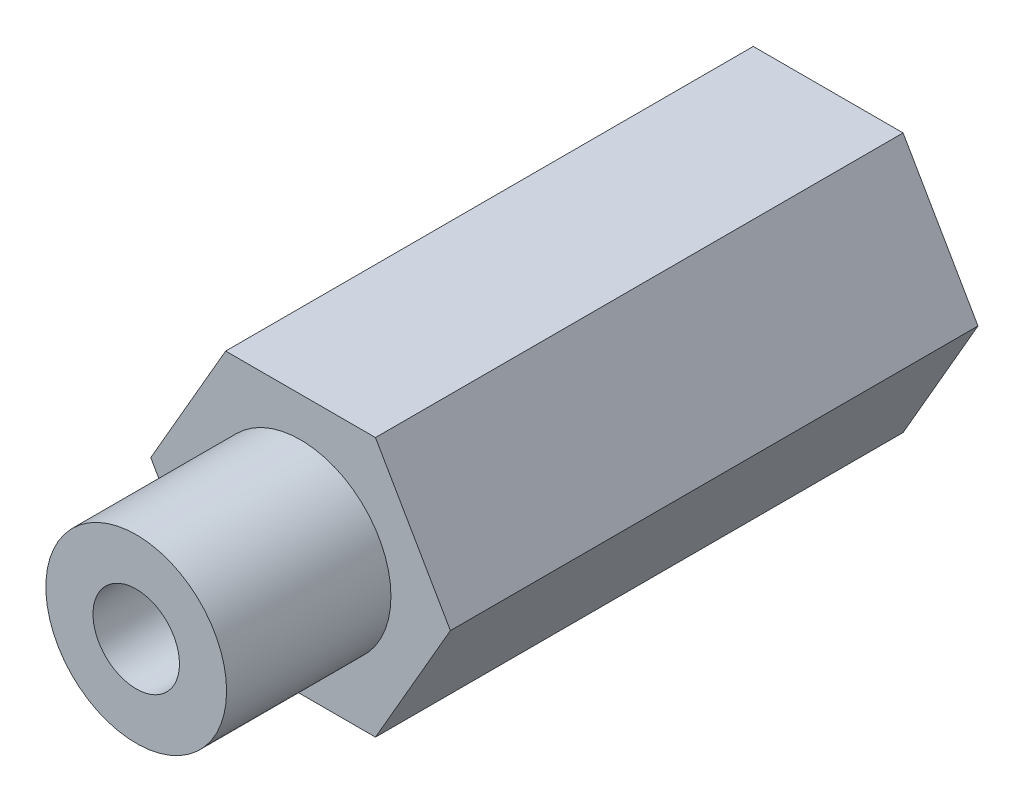
ISO-10303-21;
HEADER;
FILE_DESCRIPTION(('STEP AP214'),'2;1');
FILE_NAME('part.step','',(''),(''),'','','');
FILE_SCHEMA(('AUTOMOTIVE_DESIGN { 1 0 10303 214 1 1 1 1 }'));
ENDSEC;
DATA;
#1=APPLICATION_CONTEXT('core data for automotive mechanical design processes');
#2=APPLICATION_PROTOCOL_DEFINITION('international standard','automotive_design',2000,#1);
#3=PRODUCT_CONTEXT('',#1,'mechanical');
#4=PRODUCT('Part','Part','',(#3));
#5=PRODUCT_RELATED_PRODUCT_CATEGORY('part','',(#4));
#6=PRODUCT_DEFINITION_FORMATION('','',#4);
#7=PRODUCT_DEFINITION_CONTEXT('part definition',#1,'design');
#8=PRODUCT_DEFINITION('design','',#6,#7);
#9=PRODUCT_DEFINITION_SHAPE('','',#8);
#10=(LENGTH_UNIT() NAMED_UNIT(*) SI_UNIT(.MILLI.,.METRE.));
#11=(NAMED_UNIT(*) PLANE_ANGLE_UNIT() SI_UNIT($,.RADIAN.));
#12=(NAMED_UNIT(*) SI_UNIT($,.STERADIAN.) SOLID_ANGLE_UNIT());
#13=UNCERTAINTY_MEASURE_WITH_UNIT(LENGTH_MEASURE(1.E-05),#10,'distance_accuracy_value','');
#14=(GEOMETRIC_REPRESENTATION_CONTEXT(3) GLOBAL_UNCERTAINTY_ASSIGNED_CONTEXT((#13)) GLOBAL_UNIT_ASSIGNED_CONTEXT((#10,
#11,#12)) REPRESENTATION_CONTEXT('',''));
#15=CARTESIAN_POINT('',(0.,0.,0.));
#16=DIRECTION('',(0.,0.,1.));
#17=DIRECTION('',(1.,0.,0.));
#18=AXIS2_PLACEMENT_3D('',#15,#16,#17);
#19=CARTESIAN_POINT('',(0.,0.,0.));
#20=DIRECTION('',(0.,0.,1.));
#21=DIRECTION('',(1.,0.,0.));
#22=AXIS2_PLACEMENT_3D('',#19,#20,#21);
#23=CYLINDRICAL_SURFACE('',#22,3.175);
#24=CARTESIAN_POINT('',(0.,0.,12.065));
#25=DIRECTION('',(0.,0.,-1.));
#26=DIRECTION('',(-1.,0.,0.));
#27=AXIS2_PLACEMENT_3D('',#24,#25,#26);
#28=CIRCLE('',#27,3.175);
#29=CARTESIAN_POINT('',(-3.175,0.,12.065));
#30=VERTEX_POINT('',#29);
#31=EDGE_CURVE('E189',#30,#30,#28,.F.);
#32=ORIENTED_EDGE('',*,*,#31,.F.);
#33=EDGE_LOOP('',(#32));
#34=FACE_BOUND('',#33,.T.);
#35=CARTESIAN_POINT('',(0.,0.,50.8));
#36=DIRECTION('',(0.,0.,1.));
#37=DIRECTION('',(1.,0.,0.));
#38=AXIS2_PLACEMENT_3D('',#35,#36,#37);
#39=CIRCLE('',#38,3.175);
#40=CARTESIAN_POINT('',(3.175,0.,50.8));
#41=VERTEX_POINT('',#40);
#42=EDGE_CURVE('E192',#41,#41,#39,.T.);
#43=ORIENTED_EDGE('',*,*,#42,.T.);
#44=EDGE_LOOP('',(#43));
#45=FACE_BOUND('',#44,.T.);
#46=DIRECTION('',(0.,0.,1.));
#47=VECTOR('',#46,1.);
#48=CARTESIAN_POINT('',(1.98099578203183,-2.48118534405878,0.));
#49=LINE('',#48,#47);
#50=CARTESIAN_POINT('',(1.98099578203183,-2.48118534405879,23.4437758738829));
#51=VERTEX_POINT('',#50);
#52=CARTESIAN_POINT('',(1.98099578203183,-2.48118534405879,15.2912241261171));
#53=VERTEX_POINT('',#52);
#54=EDGE_CURVE('E11',#51,#53,#49,.F.);
#55=ORIENTED_EDGE('',*,*,#54,.F.);
#56=CARTESIAN_POINT('',(1.98099578203183,-2.48118534405878,23.4437758738829));
#57=CARTESIAN_POINT('',(1.92312071460987,-2.52741206421265,23.435214321324));
#58=CARTESIAN_POINT('',(1.86342978352521,-2.57173436993906,23.4285815523475));
#59=CARTESIAN_POINT('',(1.74088786182594,-2.6562092333999,23.4193164783604));
#60=CARTESIAN_POINT('',(1.67803740420779,-2.69636249095205,23.4166835009288));
#61=CARTESIAN_POINT('',(1.55007652557653,-2.77188957747659,23.415561861119));
#62=CARTESIAN_POINT('',(1.48498494376602,-2.80729481401831,23.4170443963517));
#63=CARTESIAN_POINT('',(1.35268256132098,-2.87338675862179,23.4240134070377));
#64=CARTESIAN_POINT('',(1.28547187073009,-2.90407371121557,23.4294996749069));
#65=CARTESIAN_POINT('',(1.08148233738491,-2.9887502671584,23.4516824059001));
#66=CARTESIAN_POINT('',(0.942199486450429,-3.03544164195341,23.4741022299698));
#67=CARTESIAN_POINT('',(0.660897996037743,-3.10887107343725,23.5311392329109));
#68=CARTESIAN_POINT('',(0.518875550320097,-3.13557895682948,23.5657747408355));
#69=CARTESIAN_POINT('',(0.22639000214134,-3.17054117246053,23.6456518320514));
#70=CARTESIAN_POINT('',(0.0759269915497634,-3.17760420453139,23.6914014870087));
#71=CARTESIAN_POINT('',(-0.222924441767528,-3.17069413279405,23.7878074461201));
#72=CARTESIAN_POINT('',(-0.371311553917492,-3.1567082960239,23.8384667028617));
#73=CARTESIAN_POINT('',(-0.694824335264102,-3.10322847098481,23.9513734554995));
#74=CARTESIAN_POINT('',(-0.869109683543074,-3.05904395711647,24.0138444274289));
#75=CARTESIAN_POINT('',(-1.20941128012506,-2.9411435853771,24.1340721794393));
#76=CARTESIAN_POINT('',(-1.37542327313888,-2.86741270343837,24.1918265431537));
#77=CARTESIAN_POINT('',(-1.61746464436229,-2.73373629444187,24.2714360835489));
#78=CARTESIAN_POINT('',(-1.6981875288251,-2.68436511709161,24.29714599282));
#79=CARTESIAN_POINT('',(-1.85558062130117,-2.57807081578418,24.3450641792581));
#80=CARTESIAN_POINT('',(-1.93225292324458,-2.52115164821748,24.367274277647));
#81=CARTESIAN_POINT('',(-2.08072268357535,-2.40008059578966,24.4075046587543));
#82=CARTESIAN_POINT('',(-2.1525246132572,-2.33593549279418,24.4255288223019));
#83=CARTESIAN_POINT('',(-2.29050424159154,-2.20080282868296,24.4568269855672));
#84=CARTESIAN_POINT('',(-2.35668310014828,-2.12981668518834,24.4701019667496));
#85=CARTESIAN_POINT('',(-2.47390545220642,-1.99184475213291,24.4899734838976));
#86=CARTESIAN_POINT('',(-2.52577765520782,-1.92565708057524,24.4972385088627));
#87=CARTESIAN_POINT('',(-2.62425603299177,-1.78913134012449,24.5077092881958));
#88=CARTESIAN_POINT('',(-2.67086052616645,-1.71879195672953,24.5109137496272));
#89=CARTESIAN_POINT('',(-2.75830940645527,-1.57462782410492,24.5131661989776));
#90=CARTESIAN_POINT('',(-2.79915838115736,-1.50080591408959,24.5122175168371));
#91=CARTESIAN_POINT('',(-2.8748033514732,-1.35027427879756,24.5062045534294));
#92=CARTESIAN_POINT('',(-2.90959712642555,-1.27356350656295,24.5011387661159));
#93=CARTESIAN_POINT('',(-2.99854106947457,-1.05473915779737,24.4812671999455));
#94=CARTESIAN_POINT('',(-3.04550891246103,-0.910031449468917,24.4618943367732));
#95=CARTESIAN_POINT('',(-3.1180425693559,-0.617428254270854,24.4116544190943));
#96=CARTESIAN_POINT('',(-3.1436057837835,-0.469532382451901,24.3807859691658));
#97=CARTESIAN_POINT('',(-3.17454030874151,-0.165758953741819,24.3079985452695));
#98=CARTESIAN_POINT('',(-3.17873406695874,-0.00988609552184648,24.265568615379));
#99=CARTESIAN_POINT('',(-3.16469077807839,0.298782765191898,24.1737948964452));
#100=CARTESIAN_POINT('',(-3.14643876680074,0.451576645935184,24.1244465144389));
#101=CARTESIAN_POINT('',(-3.08438049040226,0.773112037410079,24.0150876029896));
#102=CARTESIAN_POINT('',(-3.03732386025794,0.941051015194965,23.9545564266041));
#103=CARTESIAN_POINT('',(-2.91625559492777,1.26743074278379,23.8346114177043));
#104=CARTESIAN_POINT('',(-2.84223584363741,1.42586861594175,23.7751979272908));
#105=CARTESIAN_POINT('',(-2.67584269956907,1.71635497967397,23.6690311325829));
#106=CARTESIAN_POINT('',(-2.58579438488232,1.8494893926522,23.6216154305517));
#107=CARTESIAN_POINT('',(-2.38430327943641,2.10280480076934,23.5384408675835));
#108=CARTESIAN_POINT('',(-2.27287747391838,2.22299596223462,23.5026728125962));
#109=CARTESIAN_POINT('',(-2.09056670623055,2.39105016432318,23.4616560983209));
#110=CARTESIAN_POINT('',(-2.02686697633844,2.44529863867784,23.4500609737136));
#111=CARTESIAN_POINT('',(-1.89495241369531,2.54888124289299,23.4317390099958));
#112=CARTESIAN_POINT('',(-1.82674013715152,2.59821811599988,23.4250094400528));
#113=CARTESIAN_POINT('',(-1.6865152669383,2.69135053094324,23.4167674899596));
#114=CARTESIAN_POINT('',(-1.61450965612837,2.73515578291185,23.4152458417448));
#115=CARTESIAN_POINT('',(-1.46734189245532,2.81684305037821,23.417473409102));
#116=CARTESIAN_POINT('',(-1.39218219285023,2.85472956499727,23.4212185992183));
#117=CARTESIAN_POINT('',(-1.28982732816709,2.90134292616073,23.4296313026857));
#118=CARTESIAN_POINT('',(-1.26366650890269,2.91283156591623,23.4320642483775));
#119=CARTESIAN_POINT('',(-1.21113194501523,2.93506315074815,23.4374982217431));
#120=CARTESIAN_POINT('',(-1.18475855132721,2.94580712117742,23.4404984461926));
#121=CARTESIAN_POINT('',(-1.15827164843668,2.95618534405877,23.4437758738836));
#122=B_SPLINE_CURVE_WITH_KNOTS('',3,(#56,#57,#58,#59,#60,#61,#62,#63,#64,#65,#66,#67,#68,#69,
#70,#71,#72,#73,#74,#75,#76,#77,#78,#79,#80,#81,#82,#83,#84,#85,#86,#87,#88,#89,#90,#91,#92,#93,
#94,#95,#96,#97,#98,#99,#100,#101,#102,#103,#104,#105,#106,#107,#108,#109,#110,#111,#112,#113,
#114,#115,#116,#117,#118,#119,#120,#121),.UNSPECIFIED.,.F.,.F.,(4,2,2,2,2,2,2,2,2,2,2,2,2,2,2,2,
2,2,2,2,2,2,2,2,2,2,2,2,2,2,2,2,4),(0.,0.22363096093822,0.447224322217706,0.669256819488117,
0.891277805716111,1.33481690459422,1.7790243640916,2.24963672880022,2.72053389258267,
3.2891365264143,3.85802865729692,4.15182846041228,4.44547486828787,4.73884793655203,
5.0321603413506,5.28502750375784,5.53797516216531,5.7907200473531,6.0435574288217,
6.50141703541388,6.95933223861237,7.44222702369258,7.92544392041047,8.47703326920059,
9.02878878796331,9.52960966851272,10.0300342632666,10.2831016648069,10.5360269196985,
10.7885018318122,11.0407838816506,11.1267994979963,11.2126942225291),.UNSPECIFIED.);
#123=CARTESIAN_POINT('',(-1.15827164843663,2.95618534405878,23.4437758738829));
#124=VERTEX_POINT('',#123);
#125=EDGE_CURVE('E110',#51,#124,#122,.T.);
#126=ORIENTED_EDGE('',*,*,#125,.T.);
#127=DIRECTION('',(0.,0.,1.));
#128=VECTOR('',#127,1.);
#129=CARTESIAN_POINT('',(-1.15827164843663,2.95618534405877,0.));
#130=LINE('',#129,#128);
#131=CARTESIAN_POINT('',(-1.15827164843663,2.95618534405878,15.2912241261171));
#132=VERTEX_POINT('',#131);
#133=EDGE_CURVE('E54',#132,#124,#130,.T.);
#134=ORIENTED_EDGE('',*,*,#133,.F.);
#135=CARTESIAN_POINT('',(-1.15827164843663,2.95618534405877,15.2912241261171));
#136=CARTESIAN_POINT('',(-1.22724269613449,2.92917742550255,15.299785678676));
#137=CARTESIAN_POINT('',(-1.29547240439019,2.8996447156709,15.3064184476524));
#138=CARTESIAN_POINT('',(-1.42990074297814,2.83575773018119,15.3156835216396));
#139=CARTESIAN_POINT('',(-1.49609971287207,2.80140426602047,15.3183164990712));
#140=CARTESIAN_POINT('',(-1.62548852779178,2.72835043769749,15.319438138881));
#141=CARTESIAN_POINT('',(-1.68869615296916,2.68968209254793,15.3179556036483));
#142=CARTESIAN_POINT('',(-1.81208464720381,2.60815084067106,15.3109865929623));
#143=CARTESIAN_POINT('',(-1.87226567301019,2.56528815151035,15.3055003250931));
#144=CARTESIAN_POINT('',(-2.04759248823426,2.4309663114987,15.2833175940999));
#145=CARTESIAN_POINT('',(-2.15766983041159,2.33368951167542,15.2608977700302));
#146=CARTESIAN_POINT('',(-2.36191232866839,2.12678999059754,15.2038607670891));
#147=CARTESIAN_POINT('',(-2.45605325702619,2.01714888639457,15.1692252591645));
#148=CARTESIAN_POINT('',(-2.63257419802465,1.78133007924747,15.0893481679486));
#149=CARTESIAN_POINT('',(-2.71392246852155,1.65455680578071,15.0435985129913));
#150=CARTESIAN_POINT('',(-2.85736388751369,1.39228883670188,14.9471925538799));
#151=CARTESIAN_POINT('',(-2.91944535365253,1.25678890960072,14.8965332971383));
#152=CARTESIAN_POINT('',(-3.03488685725204,0.949878709986052,14.7836265445005));
#153=CARTESIAN_POINT('',(-3.08376461992767,0.776850913934872,14.7211555725711));
#154=CARTESIAN_POINT('',(-3.15181070117675,0.423190900476785,14.6009278205606));
#155=CARTESIAN_POINT('',(-3.17096388088128,0.242554856224572,14.5431734568463));
#156=CARTESIAN_POINT('',(-3.17621740041534,-0.0338973245199778,14.4635639164511));
#157=CARTESIAN_POINT('',(-3.17382214884668,-0.128490981806659,14.43785400718));
#158=CARTESIAN_POINT('',(-3.16046512987495,-0.31794454892484,14.3899358207419));
#159=CARTESIAN_POINT('',(-3.14950783577163,-0.412804293957816,14.367725722353));
#160=CARTESIAN_POINT('',(-3.11889210887161,-0.601918404311962,14.3274953412457));
#161=CARTESIAN_POINT('',(-3.09924178499008,-0.696173250954926,14.3094711776981));
#162=CARTESIAN_POINT('',(-3.05120327915586,-0.88323344635281,14.2781730144328));
#163=CARTESIAN_POINT('',(-3.0228169048512,-0.976039090803713,14.2648980332504));
#164=CARTESIAN_POINT('',(-2.96194088184503,-1.14654259210515,14.2450265161024));
#165=CARTESIAN_POINT('',(-2.93055677835945,-1.22455907343345,14.2377614911373));
#166=CARTESIAN_POINT('',(-2.86156120775058,-1.37810672054321,14.2272907118042));
#167=CARTESIAN_POINT('',(-2.82394776143136,-1.45363708726046,14.2240862503728));
#168=CARTESIAN_POINT('',(-2.74282240040831,-1.60145210543538,14.2218338010224));
#169=CARTESIAN_POINT('',(-2.69931523833018,-1.67373931025361,14.2227824831629));
#170=CARTESIAN_POINT('',(-2.606773503252,-1.81451559386166,14.2287954465706));
#171=CARTESIAN_POINT('',(-2.55773691322908,-1.88300327298125,14.2338612338841));
#172=CARTESIAN_POINT('',(-2.41270143975601,-2.06944316155725,14.2537328000545));
#173=CARTESIAN_POINT('',(-2.31086480971337,-2.18247236090872,14.2731056632268));
#174=CARTESIAN_POINT('',(-2.09372983789079,-2.39158994800809,14.3233455809057));
#175=CARTESIAN_POINT('',(-1.97842986299452,-2.48767627701425,14.3542140308342));
#176=CARTESIAN_POINT('',(-1.7308216192159,-2.66635307583693,14.4270014547305));
#177=CARTESIAN_POINT('',(-1.59792864334552,-2.74792140610037,14.469431384621));
#178=CARTESIAN_POINT('',(-1.32359192417004,-2.89009399153417,14.5612051035548));
#179=CARTESIAN_POINT('',(-1.18214253626473,-2.95068422646922,14.6105534855611));
#180=CARTESIAN_POINT('',(-0.872655580832449,-3.0577078783305,14.7199123970104));
#181=CARTESIAN_POINT('',(-0.703687844712989,-3.10092513010148,14.7804435733959));
#182=CARTESIAN_POINT('',(-0.36050057667574,-3.15926680052785,14.9003885822957));
#183=CARTESIAN_POINT('',(-0.186279477954181,-3.17438275210757,14.9598020727092));
#184=CARTESIAN_POINT('',(0.148485664525052,-3.17552524419493,15.0659688674171));
#185=CARTESIAN_POINT('',(0.3088076056255,-3.16410832259735,15.1133845694483));
#186=CARTESIAN_POINT('',(0.628930736947921,-3.11626961070314,15.1965591324165));
#187=CARTESIAN_POINT('',(0.788732238846228,-3.07986761322003,15.2323271874038));
#188=CARTESIAN_POINT('',(1.02542683091156,-3.00600895806321,15.2733439016791));
#189=CARTESIAN_POINT('',(1.10425725276529,-2.97796761093976,15.2849390262864));
#190=CARTESIAN_POINT('',(1.25991970072733,-2.91551755066927,15.3032609900042));
#191=CARTESIAN_POINT('',(1.33675282445308,-2.88111242288583,15.3099905599472));
#192=CARTESIAN_POINT('',(1.48752029681643,-2.80624033051048,15.3182325100404));
#193=CARTESIAN_POINT('',(1.56145956324539,-2.76578426831837,15.3197541582553));
#194=CARTESIAN_POINT('',(1.70578669387352,-2.67917688009255,15.317526590898));
#195=CARTESIAN_POINT('',(1.77617722779703,-2.63302992820326,15.3137814007817));
#196=CARTESIAN_POINT('',(1.86772301506192,-2.56769469576847,15.3053686973144));
#197=CARTESIAN_POINT('',(1.89075287857732,-2.55078308157944,15.3029357516225));
#198=CARTESIAN_POINT('',(1.93627327775188,-2.51640260709212,15.2975017782569));
#199=CARTESIAN_POINT('',(1.95876452592515,-2.49893456338892,15.2945015538074));
#200=CARTESIAN_POINT('',(1.9809957820318,-2.48118534405883,15.2912241261164));
#201=B_SPLINE_CURVE_WITH_KNOTS('',3,(#135,#136,#137,#138,#139,#140,#141,#142,#143,#144,#145,
#146,#147,#148,#149,#150,#151,#152,#153,#154,#155,#156,#157,#158,#159,#160,#161,#162,#163,#164,
#165,#166,#167,#168,#169,#170,#171,#172,#173,#174,#175,#176,#177,#178,#179,#180,#181,#182,#183,
#184,#185,#186,#187,#188,#189,#190,#191,#192,#193,#194,#195,#196,#197,#198,#199,#200),
.UNSPECIFIED.,.F.,.F.,(4,2,2,2,2,2,2,2,2,2,2,2,2,2,2,2,2,2,2,2,2,2,2,2,2,2,2,2,2,2,2,2,4),(0.,
0.22363096093822,0.447224322217707,0.669256819488118,0.891277805716112,1.33481690459422,
1.7790243640916,2.24963672880022,2.72053389258267,3.28913652641431,3.85802865729692,
4.15182846041228,4.44547486828788,4.73884793655203,5.0321603413506,5.28502750375784,
5.53797516216531,5.7907200473531,6.0435574288217,6.50141703541388,6.95933223861237,
7.44222702369258,7.92544392041047,8.4770332692006,9.02878878796331,9.52960966851273,
10.0300342632666,10.2831016648069,10.5360269196985,10.7885018318122,11.0407838816506,
11.1267994979963,11.2126942225291),.UNSPECIFIED.);
#202=EDGE_CURVE('E119',#132,#53,#201,.T.);
#203=ORIENTED_EDGE('',*,*,#202,.T.);
#204=EDGE_LOOP('',(#55,#126,#134,#203));
#205=FACE_BOUND('',#204,.T.);
#206=ADVANCED_FACE('F45',(#34,#45,#205),#23,.F.);
#207=CARTESIAN_POINT('',(10.9985226280624,0.,50.8));
#208=DIRECTION('',(-0.866025403784438,-0.5,0.));
#209=DIRECTION('',(0.5,-0.866025403784439,0.));
#210=AXIS2_PLACEMENT_3D('',#207,#208,#209);
#211=PLANE('',#210);
#212=DIRECTION('',(-0.5,0.866025403784439,0.));
#213=VECTOR('',#212,1.);
#214=CARTESIAN_POINT('',(10.9985226280624,0.,38.735));
#215=LINE('',#214,#213);
#216=CARTESIAN_POINT('',(10.9985226280624,0.,38.735));
#217=VERTEX_POINT('',#216);
#218=CARTESIAN_POINT('',(5.49926131403119,9.525,38.735));
#219=VERTEX_POINT('',#218);
#220=EDGE_CURVE('E371',#217,#219,#215,.T.);
#221=ORIENTED_EDGE('',*,*,#220,.F.);
#222=DIRECTION('',(0.,0.,-1.));
#223=VECTOR('',#222,1.);
#224=CARTESIAN_POINT('',(10.9985226280624,0.,50.8));
#225=LINE('',#224,#223);
#226=CARTESIAN_POINT('',(10.9985226280624,0.,0.));
#227=VERTEX_POINT('',#226);
#228=EDGE_CURVE('E225',#217,#227,#225,.T.);
#229=ORIENTED_EDGE('',*,*,#228,.T.);
#230=DIRECTION('',(-0.5,0.866025403784439,0.));
#231=VECTOR('',#230,1.);
#232=CARTESIAN_POINT('',(10.9985226280624,0.,0.));
#233=LINE('',#232,#231);
#234=CARTESIAN_POINT('',(5.49926131403119,9.525,0.));
#235=VERTEX_POINT('',#234);
#236=EDGE_CURVE('E195',#227,#235,#233,.T.);
#237=ORIENTED_EDGE('',*,*,#236,.T.);
#238=DIRECTION('',(0.,0.,-1.));
#239=VECTOR('',#238,1.);
#240=CARTESIAN_POINT('',(5.49926131403119,9.525,50.8));
#241=LINE('',#240,#239);
#242=EDGE_CURVE('E240',#219,#235,#241,.T.);
#243=ORIENTED_EDGE('',*,*,#242,.F.);
#244=EDGE_LOOP('',(#221,#229,#237,#243));
#245=FACE_BOUND('',#244,.T.);
#246=ADVANCED_FACE('F47',(#245),#211,.F.);
#247=CARTESIAN_POINT('',(5.49926131403119,9.525,50.8));
#248=DIRECTION('',(0.,-1.,0.));
#249=DIRECTION('',(1.,0.,0.));
#250=AXIS2_PLACEMENT_3D('',#247,#248,#249);
#251=PLANE('',#250);
#252=DIRECTION('',(-1.,0.,0.));
#253=VECTOR('',#252,1.);
#254=CARTESIAN_POINT('',(5.49926131403119,9.525,38.735));
#255=LINE('',#254,#253);
#256=CARTESIAN_POINT('',(-5.49926131403119,9.525,38.735));
#257=VERTEX_POINT('',#256);
#258=EDGE_CURVE('E376',#219,#257,#255,.T.);
#259=ORIENTED_EDGE('',*,*,#258,.F.);
#260=ORIENTED_EDGE('',*,*,#242,.T.);
#261=DIRECTION('',(-1.,0.,0.));
#262=VECTOR('',#261,1.);
#263=CARTESIAN_POINT('',(5.49926131403119,9.525,0.));
#264=LINE('',#263,#262);
#265=CARTESIAN_POINT('',(-5.49926131403119,9.525,0.));
#266=VERTEX_POINT('',#265);
#267=EDGE_CURVE('E200',#235,#266,#264,.T.);
#268=ORIENTED_EDGE('',*,*,#267,.T.);
#269=DIRECTION('',(0.,0.,-1.));
#270=VECTOR('',#269,1.);
#271=CARTESIAN_POINT('',(-5.49926131403119,9.525,50.8));
#272=LINE('',#271,#270);
#273=EDGE_CURVE('E237',#257,#266,#272,.T.);
#274=ORIENTED_EDGE('',*,*,#273,.F.);
#275=EDGE_LOOP('',(#259,#260,#268,#274));
#276=FACE_BOUND('',#275,.T.);
#277=ADVANCED_FACE('F184',(#276),#251,.F.);
#278=CARTESIAN_POINT('',(-5.49926131403119,9.525,50.8));
#279=DIRECTION('',(0.866025403784439,-0.5,0.));
#280=DIRECTION('',(0.5,0.866025403784439,0.));
#281=AXIS2_PLACEMENT_3D('',#278,#279,#280);
#282=PLANE('',#281);
#283=DIRECTION('',(-0.5,-0.866025403784439,0.));
#284=VECTOR('',#283,1.);
#285=CARTESIAN_POINT('',(-5.49926131403119,9.525,38.735));
#286=LINE('',#285,#284);
#287=CARTESIAN_POINT('',(-10.9985226280624,0.,38.735));
#288=VERTEX_POINT('',#287);
#289=EDGE_CURVE('E384',#257,#288,#286,.T.);
#290=ORIENTED_EDGE('',*,*,#289,.F.);
#291=ORIENTED_EDGE('',*,*,#273,.T.);
#292=DIRECTION('',(-0.5,-0.866025403784439,0.));
#293=VECTOR('',#292,1.);
#294=CARTESIAN_POINT('',(-5.49926131403119,9.525,0.));
#295=LINE('',#294,#293);
#296=CARTESIAN_POINT('',(-10.9985226280624,0.,0.));
#297=VERTEX_POINT('',#296);
#298=EDGE_CURVE('E209',#266,#297,#295,.T.);
#299=ORIENTED_EDGE('',*,*,#298,.T.);
#300=DIRECTION('',(0.,0.,-1.));
#301=VECTOR('',#300,1.);
#302=CARTESIAN_POINT('',(-10.9985226280624,0.,50.8));
#303=LINE('',#302,#301);
#304=EDGE_CURVE('E234',#288,#297,#303,.T.);
#305=ORIENTED_EDGE('',*,*,#304,.F.);
#306=EDGE_LOOP('',(#290,#291,#299,#305));
#307=FACE_BOUND('',#306,.T.);
#308=ADVANCED_FACE('F259',(#307),#282,.F.);
#309=CARTESIAN_POINT('',(-10.9985226280624,0.,50.8));
#310=DIRECTION('',(0.866025403784439,0.5,0.));
#311=DIRECTION('',(-0.5,0.866025403784439,0.));
#312=AXIS2_PLACEMENT_3D('',#309,#310,#311);
#313=PLANE('',#312);
#314=CARTESIAN_POINT('',(-8.24889197104679,-4.7625,19.3675));
#315=DIRECTION('',(-0.866025403784439,-0.5,0.));
#316=DIRECTION('',(0.5,-0.866025403784439,0.));
#317=AXIS2_PLACEMENT_3D('',#314,#315,#316);
#318=CIRCLE('',#317,5.145);
#319=CARTESIAN_POINT('',(-5.67639197104679,-9.21820070247094,19.3675));
#320=VERTEX_POINT('',#319);
#321=EDGE_CURVE('E124',#320,#320,#318,.T.);
#322=ORIENTED_EDGE('',*,*,#321,.F.);
#323=EDGE_LOOP('',(#322));
#324=FACE_BOUND('',#323,.T.);
#325=DIRECTION('',(0.5,-0.866025403784439,0.));
#326=VECTOR('',#325,1.);
#327=CARTESIAN_POINT('',(-10.9985226280624,0.,38.735));
#328=LINE('',#327,#326);
#329=CARTESIAN_POINT('',(-5.49926131403119,-9.525,38.735));
#330=VERTEX_POINT('',#329);
#331=EDGE_CURVE('E202',#288,#330,#328,.T.);
#332=ORIENTED_EDGE('',*,*,#331,.F.);
#333=ORIENTED_EDGE('',*,*,#304,.T.);
#334=DIRECTION('',(0.5,-0.866025403784439,0.));
#335=VECTOR('',#334,1.);
#336=CARTESIAN_POINT('',(-10.9985226280624,0.,0.));
#337=LINE('',#336,#335);
#338=CARTESIAN_POINT('',(-5.49926131403119,-9.525,0.));
#339=VERTEX_POINT('',#338);
#340=EDGE_CURVE('E213',#297,#339,#337,.T.);
#341=ORIENTED_EDGE('',*,*,#340,.T.);
#342=DIRECTION('',(0.,0.,-1.));
#343=VECTOR('',#342,1.);
#344=CARTESIAN_POINT('',(-5.49926131403119,-9.525,50.8));
#345=LINE('',#344,#343);
#346=EDGE_CURVE('E231',#330,#339,#345,.T.);
#347=ORIENTED_EDGE('',*,*,#346,.F.);
#348=EDGE_LOOP('',(#332,#333,#341,#347));
#349=FACE_BOUND('',#348,.T.);
#350=ADVANCED_FACE('F255',(#324,#349),#313,.F.);
#351=CARTESIAN_POINT('',(-5.49926131403119,-9.525,50.8));
#352=DIRECTION('',(0.,1.,0.));
#353=DIRECTION('',(-1.,0.,0.));
#354=AXIS2_PLACEMENT_3D('',#351,#352,#353);
#355=PLANE('',#354);
#356=DIRECTION('',(1.,0.,0.));
#357=VECTOR('',#356,1.);
#358=CARTESIAN_POINT('',(-5.49926131403119,-9.525,38.735));
#359=LINE('',#358,#357);
#360=CARTESIAN_POINT('',(5.49926131403119,-9.525,38.735));
#361=VERTEX_POINT('',#360);
#362=EDGE_CURVE('E68',#330,#361,#359,.T.);
#363=ORIENTED_EDGE('',*,*,#362,.F.);
#364=ORIENTED_EDGE('',*,*,#346,.T.);
#365=DIRECTION('',(1.,0.,0.));
#366=VECTOR('',#365,1.);
#367=CARTESIAN_POINT('',(-5.49926131403119,-9.525,0.));
#368=LINE('',#367,#366);
#369=CARTESIAN_POINT('',(5.49926131403119,-9.525,0.));
#370=VERTEX_POINT('',#369);
#371=EDGE_CURVE('E217',#339,#370,#368,.T.);
#372=ORIENTED_EDGE('',*,*,#371,.T.);
#373=DIRECTION('',(0.,0.,-1.));
#374=VECTOR('',#373,1.);
#375=CARTESIAN_POINT('',(5.49926131403119,-9.525,50.8));
#376=LINE('',#375,#374);
#377=EDGE_CURVE('E228',#361,#370,#376,.T.);
#378=ORIENTED_EDGE('',*,*,#377,.F.);
#379=EDGE_LOOP('',(#363,#364,#372,#378));
#380=FACE_BOUND('',#379,.T.);
#381=ADVANCED_FACE('F258',(#380),#355,.F.);
#382=CARTESIAN_POINT('',(5.49926131403119,-9.525,50.8));
#383=DIRECTION('',(-0.866025403784439,0.5,0.));
#384=DIRECTION('',(-0.5,-0.866025403784439,0.));
#385=AXIS2_PLACEMENT_3D('',#382,#383,#384);
#386=PLANE('',#385);
#387=DIRECTION('',(0.5,0.866025403784439,0.));
#388=VECTOR('',#387,1.);
#389=CARTESIAN_POINT('',(5.49926131403119,-9.525,38.735));
#390=LINE('',#389,#388);
#391=EDGE_CURVE('E368',#361,#217,#390,.T.);
#392=ORIENTED_EDGE('',*,*,#391,.F.);
#393=ORIENTED_EDGE('',*,*,#377,.T.);
#394=DIRECTION('',(0.5,0.866025403784439,0.));
#395=VECTOR('',#394,1.);
#396=CARTESIAN_POINT('',(5.49926131403119,-9.525,0.));
#397=LINE('',#396,#395);
#398=EDGE_CURVE('E221',#370,#227,#397,.T.);
#399=ORIENTED_EDGE('',*,*,#398,.T.);
#400=ORIENTED_EDGE('',*,*,#228,.F.);
#401=EDGE_LOOP('',(#392,#393,#399,#400));
#402=FACE_BOUND('',#401,.T.);
#403=ADVANCED_FACE('F342',(#402),#386,.F.);
#404=CARTESIAN_POINT('',(0.,0.,50.8));
#405=DIRECTION('',(0.,0.,1.));
#406=DIRECTION('',(1.,0.,0.));
#407=AXIS2_PLACEMENT_3D('',#404,#405,#406);
#408=PLANE('',#407);
#409=ORIENTED_EDGE('',*,*,#42,.F.);
#410=EDGE_LOOP('',(#409));
#411=FACE_BOUND('',#410,.T.);
#412=CARTESIAN_POINT('',(0.,0.,50.8));
#413=DIRECTION('',(0.,0.,1.));
#414=DIRECTION('',(1.,0.,0.));
#415=AXIS2_PLACEMENT_3D('',#412,#413,#414);
#416=CIRCLE('',#415,6.635);
#417=CARTESIAN_POINT('',(6.635,0.,50.8));
#418=VERTEX_POINT('',#417);
#419=EDGE_CURVE('E244',#418,#418,#416,.T.);
#420=ORIENTED_EDGE('',*,*,#419,.T.);
#421=EDGE_LOOP('',(#420));
#422=FACE_BOUND('',#421,.T.);
#423=ADVANCED_FACE('F174',(#411,#422),#408,.T.);
#424=CARTESIAN_POINT('',(0.,0.,0.));
#425=DIRECTION('',(0.,0.,1.));
#426=DIRECTION('',(1.,0.,0.));
#427=AXIS2_PLACEMENT_3D('',#424,#425,#426);
#428=PLANE('',#427);
#429=CARTESIAN_POINT('',(0.,0.,0.));
#430=DIRECTION('',(0.,0.,-1.));
#431=DIRECTION('',(-1.,0.,0.));
#432=AXIS2_PLACEMENT_3D('',#429,#430,#431);
#433=CIRCLE('',#432,6.86);
#434=CARTESIAN_POINT('',(-6.86,0.,0.));
#435=VERTEX_POINT('',#434);
#436=EDGE_CURVE('E127',#435,#435,#433,.T.);
#437=ORIENTED_EDGE('',*,*,#436,.F.);
#438=EDGE_LOOP('',(#437));
#439=FACE_BOUND('',#438,.T.);
#440=ORIENTED_EDGE('',*,*,#236,.F.);
#441=ORIENTED_EDGE('',*,*,#398,.F.);
#442=ORIENTED_EDGE('',*,*,#371,.F.);
#443=ORIENTED_EDGE('',*,*,#340,.F.);
#444=ORIENTED_EDGE('',*,*,#298,.F.);
#445=ORIENTED_EDGE('',*,*,#267,.F.);
#446=EDGE_LOOP('',(#440,#441,#442,#443,#444,#445));
#447=FACE_BOUND('',#446,.T.);
#448=ADVANCED_FACE('F168',(#439,#447),#428,.F.);
#449=CARTESIAN_POINT('',(0.,0.,38.735));
#450=DIRECTION('',(0.,0.,1.));
#451=DIRECTION('',(1.,0.,0.));
#452=AXIS2_PLACEMENT_3D('',#449,#450,#451);
#453=PLANE('',#452);
#454=CARTESIAN_POINT('',(0.,0.,38.735));
#455=DIRECTION('',(0.,0.,1.));
#456=DIRECTION('',(1.,0.,0.));
#457=AXIS2_PLACEMENT_3D('',#454,#455,#456);
#458=CIRCLE('',#457,6.635);
#459=CARTESIAN_POINT('',(6.635,0.,38.735));
#460=VERTEX_POINT('',#459);
#461=EDGE_CURVE('E372',#460,#460,#458,.T.);
#462=ORIENTED_EDGE('',*,*,#461,.F.);
#463=EDGE_LOOP('',(#462));
#464=FACE_BOUND('',#463,.T.);
#465=ORIENTED_EDGE('',*,*,#391,.T.);
#466=ORIENTED_EDGE('',*,*,#220,.T.);
#467=ORIENTED_EDGE('',*,*,#258,.T.);
#468=ORIENTED_EDGE('',*,*,#289,.T.);
#469=ORIENTED_EDGE('',*,*,#331,.T.);
#470=ORIENTED_EDGE('',*,*,#362,.T.);
#471=EDGE_LOOP('',(#465,#466,#467,#468,#469,#470));
#472=FACE_BOUND('',#471,.T.);
#473=ADVANCED_FACE('F165',(#464,#472),#453,.T.);
#474=CARTESIAN_POINT('',(0.,0.,38.735));
#475=DIRECTION('',(0.,0.,1.));
#476=DIRECTION('',(1.,0.,0.));
#477=AXIS2_PLACEMENT_3D('',#474,#475,#476);
#478=CYLINDRICAL_SURFACE('',#477,6.635);
#479=ORIENTED_EDGE('',*,*,#461,.T.);
#480=EDGE_LOOP('',(#479));
#481=FACE_BOUND('',#480,.T.);
#482=ORIENTED_EDGE('',*,*,#419,.F.);
#483=EDGE_LOOP('',(#482));
#484=FACE_BOUND('',#483,.T.);
#485=ADVANCED_FACE('F159',(#481,#484),#478,.T.);
#486=CARTESIAN_POINT('',(0.,0.,12.065));
#487=DIRECTION('',(0.,0.,-1.));
#488=DIRECTION('',(-1.,0.,0.));
#489=AXIS2_PLACEMENT_3D('',#486,#487,#488);
#490=PLANE('',#489);
#491=CARTESIAN_POINT('',(0.,0.,12.065));
#492=DIRECTION('',(0.,0.,-1.));
#493=DIRECTION('',(-1.,0.,0.));
#494=AXIS2_PLACEMENT_3D('',#491,#492,#493);
#495=CIRCLE('',#494,6.86);
#496=CARTESIAN_POINT('',(-6.86,0.,12.065));
#497=VERTEX_POINT('',#496);
#498=EDGE_CURVE('E131',#497,#497,#495,.T.);
#499=ORIENTED_EDGE('',*,*,#498,.T.);
#500=EDGE_LOOP('',(#499));
#501=FACE_BOUND('',#500,.T.);
#502=ORIENTED_EDGE('',*,*,#31,.T.);
#503=EDGE_LOOP('',(#502));
#504=FACE_BOUND('',#503,.T.);
#505=ADVANCED_FACE('F154',(#501,#504),#490,.T.);
#506=CARTESIAN_POINT('',(0.,0.,12.065));
#507=DIRECTION('',(0.,0.,-1.));
#508=DIRECTION('',(-1.,0.,0.));
#509=AXIS2_PLACEMENT_3D('',#506,#507,#508);
#510=CYLINDRICAL_SURFACE('',#509,6.86);
#511=ORIENTED_EDGE('',*,*,#498,.F.);
#512=EDGE_LOOP('',(#511));
#513=FACE_BOUND('',#512,.T.);
#514=ORIENTED_EDGE('',*,*,#436,.T.);
#515=EDGE_LOOP('',(#514));
#516=FACE_BOUND('',#515,.T.);
#517=ADVANCED_FACE('F158',(#513,#516),#510,.F.);
#518=CARTESIAN_POINT('',(0.411362066797597,0.2375,19.3675));
#519=DIRECTION('',(-0.866025403784439,-0.5,0.));
#520=DIRECTION('',(0.5,-0.866025403784439,0.));
#521=AXIS2_PLACEMENT_3D('',#518,#519,#520);
#522=PLANE('',#521);
#523=ORIENTED_EDGE('',*,*,#54,.T.);
#524=CARTESIAN_POINT('',(0.411362066797597,0.2375,19.3675));
#525=DIRECTION('',(-0.866025403784439,-0.5,0.));
#526=DIRECTION('',(0.5,-0.866025403784439,0.));
#527=AXIS2_PLACEMENT_3D('',#524,#525,#526);
#528=CIRCLE('',#527,5.145);
#529=EDGE_CURVE('E113',#53,#51,#528,.T.);
#530=ORIENTED_EDGE('',*,*,#529,.T.);
#531=EDGE_LOOP('',(#523,#530));
#532=FACE_BOUND('',#531,.T.);
#533=ADVANCED_FACE('F122',(#532),#522,.T.);
#534=ORIENTED_EDGE('',*,*,#133,.T.);
#535=EDGE_CURVE('E60',#124,#132,#528,.T.);
#536=ORIENTED_EDGE('',*,*,#535,.T.);
#537=EDGE_LOOP('',(#534,#536));
#538=FACE_BOUND('',#537,.T.);
#539=ADVANCED_FACE('F152',(#538),#522,.T.);
#540=CARTESIAN_POINT('',(0.411362066797597,0.2375,19.3675));
#541=DIRECTION('',(-0.866025403784438,-0.5,0.));
#542=DIRECTION('',(0.5,-0.866025403784438,0.));
#543=AXIS2_PLACEMENT_3D('',#540,#541,#542);
#544=CYLINDRICAL_SURFACE('',#543,5.145);
#545=ORIENTED_EDGE('',*,*,#321,.T.);
#546=EDGE_LOOP('',(#545));
#547=FACE_BOUND('',#546,.T.);
#548=ORIENTED_EDGE('',*,*,#535,.F.);
#549=ORIENTED_EDGE('',*,*,#125,.F.);
#550=ORIENTED_EDGE('',*,*,#529,.F.);
#551=ORIENTED_EDGE('',*,*,#202,.F.);
#552=EDGE_LOOP('',(#548,#549,#550,#551));
#553=FACE_BOUND('',#552,.T.);
#554=ADVANCED_FACE('F112',(#547,#553),#544,.F.);
#555=CLOSED_SHELL('',(#206,#246,#277,#308,#350,#381,#403,#423,#448,#473,#485,#505,#517,#533,
#539,#554));
#556=MANIFOLD_SOLID_BREP('B2',#555);
#557=ADVANCED_BREP_SHAPE_REPRESENTATION('',(#18,#556),#14);
#558=SHAPE_DEFINITION_REPRESENTATION(#9,#557);
ENDSEC;
END-ISO-10303-21;
